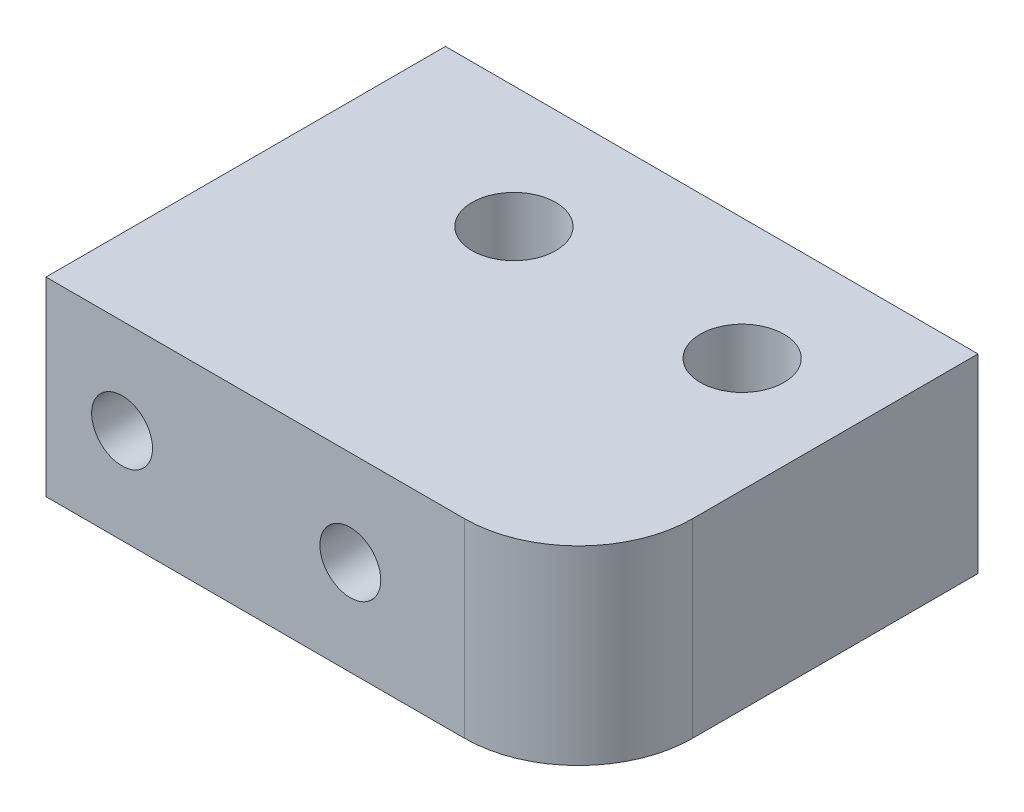
ISO-10303-21;
HEADER;
FILE_DESCRIPTION(('STEP AP214'),'2;1');
FILE_NAME('part.step','',(''),(''),'','','');
FILE_SCHEMA(('AUTOMOTIVE_DESIGN { 1 0 10303 214 1 1 1 1 }'));
ENDSEC;
DATA;
#1=APPLICATION_CONTEXT('core data for automotive mechanical design processes');
#2=APPLICATION_PROTOCOL_DEFINITION('international standard','automotive_design',2000,#1);
#3=PRODUCT_CONTEXT('',#1,'mechanical');
#4=PRODUCT('Part','Part','',(#3));
#5=PRODUCT_RELATED_PRODUCT_CATEGORY('part','',(#4));
#6=PRODUCT_DEFINITION_FORMATION('','',#4);
#7=PRODUCT_DEFINITION_CONTEXT('part definition',#1,'design');
#8=PRODUCT_DEFINITION('design','',#6,#7);
#9=PRODUCT_DEFINITION_SHAPE('','',#8);
#10=(LENGTH_UNIT() NAMED_UNIT(*) SI_UNIT(.MILLI.,.METRE.));
#11=(NAMED_UNIT(*) PLANE_ANGLE_UNIT() SI_UNIT($,.RADIAN.));
#12=(NAMED_UNIT(*) SI_UNIT($,.STERADIAN.) SOLID_ANGLE_UNIT());
#13=UNCERTAINTY_MEASURE_WITH_UNIT(LENGTH_MEASURE(1.E-05),#10,'distance_accuracy_value','');
#14=(GEOMETRIC_REPRESENTATION_CONTEXT(3) GLOBAL_UNCERTAINTY_ASSIGNED_CONTEXT((#13)) GLOBAL_UNIT_ASSIGNED_CONTEXT((#10,
#11,#12)) REPRESENTATION_CONTEXT('',''));
#15=CARTESIAN_POINT('',(0.,0.,0.));
#16=DIRECTION('',(0.,0.,1.));
#17=DIRECTION('',(1.,0.,0.));
#18=AXIS2_PLACEMENT_3D('',#15,#16,#17);
#19=CARTESIAN_POINT('',(7.,5.,-5.25));
#20=DIRECTION('',(-1.,0.,0.));
#21=DIRECTION('',(0.,0.,1.));
#22=AXIS2_PLACEMENT_3D('',#19,#20,#21);
#23=PLANE('',#22);
#24=DIRECTION('',(0.,0.,-1.));
#25=VECTOR('',#24,1.);
#26=CARTESIAN_POINT('',(7.,5.,-5.25));
#27=LINE('',#26,#25);
#28=CARTESIAN_POINT('',(7.,5.,2.25));
#29=VERTEX_POINT('',#28);
#30=CARTESIAN_POINT('',(7.,5.,-5.25));
#31=VERTEX_POINT('',#30);
#32=EDGE_CURVE('E81',#29,#31,#27,.T.);
#33=ORIENTED_EDGE('',*,*,#32,.F.);
#34=DIRECTION('',(0.,-1.,0.));
#35=VECTOR('',#34,1.);
#36=CARTESIAN_POINT('',(7.,5.,2.25));
#37=LINE('',#36,#35);
#38=CARTESIAN_POINT('',(7.,0.,2.25));
#39=VERTEX_POINT('',#38);
#40=EDGE_CURVE('E104',#29,#39,#37,.T.);
#41=ORIENTED_EDGE('',*,*,#40,.T.);
#42=DIRECTION('',(0.,0.,-1.));
#43=VECTOR('',#42,1.);
#44=CARTESIAN_POINT('',(7.,0.,-5.25));
#45=LINE('',#44,#43);
#46=CARTESIAN_POINT('',(7.,0.,-5.25));
#47=VERTEX_POINT('',#46);
#48=EDGE_CURVE('E102',#39,#47,#45,.T.);
#49=ORIENTED_EDGE('',*,*,#48,.T.);
#50=DIRECTION('',(0.,-1.,0.));
#51=VECTOR('',#50,1.);
#52=CARTESIAN_POINT('',(7.,5.,-5.25));
#53=LINE('',#52,#51);
#54=EDGE_CURVE('E96',#31,#47,#53,.T.);
#55=ORIENTED_EDGE('',*,*,#54,.F.);
#56=EDGE_LOOP('',(#33,#41,#49,#55));
#57=FACE_BOUND('',#56,.T.);
#58=ADVANCED_FACE('F35',(#57),#23,.F.);
#59=CARTESIAN_POINT('',(-7.,5.,-5.25));
#60=DIRECTION('',(0.,0.,1.));
#61=DIRECTION('',(1.,0.,0.));
#62=AXIS2_PLACEMENT_3D('',#59,#60,#61);
#63=PLANE('',#62);
#64=CARTESIAN_POINT('',(-5.,2.5,-5.25));
#65=DIRECTION('',(0.,0.,1.));
#66=DIRECTION('',(1.,0.,0.));
#67=AXIS2_PLACEMENT_3D('',#64,#65,#66);
#68=CIRCLE('',#67,0.799999999999997);
#69=CARTESIAN_POINT('',(-4.2,2.5,-5.25));
#70=VERTEX_POINT('',#69);
#71=EDGE_CURVE('E152',#70,#70,#68,.T.);
#72=ORIENTED_EDGE('',*,*,#71,.T.);
#73=EDGE_LOOP('',(#72));
#74=FACE_BOUND('',#73,.T.);
#75=CARTESIAN_POINT('',(1.,2.5,-5.25));
#76=DIRECTION('',(0.,0.,1.));
#77=DIRECTION('',(1.,0.,0.));
#78=AXIS2_PLACEMENT_3D('',#75,#76,#77);
#79=CIRCLE('',#78,0.799999999999997);
#80=CARTESIAN_POINT('',(1.8,2.5,-5.25));
#81=VERTEX_POINT('',#80);
#82=EDGE_CURVE('E146',#81,#81,#79,.T.);
#83=ORIENTED_EDGE('',*,*,#82,.T.);
#84=EDGE_LOOP('',(#83));
#85=FACE_BOUND('',#84,.T.);
#86=DIRECTION('',(-1.,0.,0.));
#87=VECTOR('',#86,1.);
#88=CARTESIAN_POINT('',(-7.,0.,-5.25));
#89=LINE('',#88,#87);
#90=CARTESIAN_POINT('',(-7.,0.,-5.25));
#91=VERTEX_POINT('',#90);
#92=EDGE_CURVE('E117',#47,#91,#89,.T.);
#93=ORIENTED_EDGE('',*,*,#92,.T.);
#94=DIRECTION('',(0.,-1.,0.));
#95=VECTOR('',#94,1.);
#96=CARTESIAN_POINT('',(-7.,5.,-5.25));
#97=LINE('',#96,#95);
#98=CARTESIAN_POINT('',(-7.,5.,-5.25));
#99=VERTEX_POINT('',#98);
#100=EDGE_CURVE('E98',#99,#91,#97,.T.);
#101=ORIENTED_EDGE('',*,*,#100,.F.);
#102=DIRECTION('',(-1.,0.,0.));
#103=VECTOR('',#102,1.);
#104=CARTESIAN_POINT('',(-7.,5.,-5.25));
#105=LINE('',#104,#103);
#106=EDGE_CURVE('E84',#31,#99,#105,.T.);
#107=ORIENTED_EDGE('',*,*,#106,.F.);
#108=ORIENTED_EDGE('',*,*,#54,.T.);
#109=EDGE_LOOP('',(#93,#101,#107,#108));
#110=FACE_BOUND('',#109,.T.);
#111=ADVANCED_FACE('F95',(#74,#85,#110),#63,.F.);
#112=CARTESIAN_POINT('',(-7.,5.,-5.25));
#113=DIRECTION('',(1.,0.,0.));
#114=DIRECTION('',(0.,0.,-1.));
#115=AXIS2_PLACEMENT_3D('',#112,#113,#114);
#116=PLANE('',#115);
#117=DIRECTION('',(0.,0.,1.));
#118=VECTOR('',#117,1.);
#119=CARTESIAN_POINT('',(-7.,0.,-5.25));
#120=LINE('',#119,#118);
#121=CARTESIAN_POINT('',(-7.,0.,5.25));
#122=VERTEX_POINT('',#121);
#123=EDGE_CURVE('E115',#91,#122,#120,.T.);
#124=ORIENTED_EDGE('',*,*,#123,.T.);
#125=DIRECTION('',(0.,-1.,0.));
#126=VECTOR('',#125,1.);
#127=CARTESIAN_POINT('',(-7.,5.,5.25));
#128=LINE('',#127,#126);
#129=CARTESIAN_POINT('',(-7.,5.,5.25));
#130=VERTEX_POINT('',#129);
#131=EDGE_CURVE('E107',#130,#122,#128,.T.);
#132=ORIENTED_EDGE('',*,*,#131,.F.);
#133=DIRECTION('',(0.,0.,1.));
#134=VECTOR('',#133,1.);
#135=CARTESIAN_POINT('',(-7.,5.,-5.25));
#136=LINE('',#135,#134);
#137=EDGE_CURVE('E100',#99,#130,#136,.T.);
#138=ORIENTED_EDGE('',*,*,#137,.F.);
#139=ORIENTED_EDGE('',*,*,#100,.T.);
#140=EDGE_LOOP('',(#124,#132,#138,#139));
#141=FACE_BOUND('',#140,.T.);
#142=ADVANCED_FACE('F164',(#141),#116,.F.);
#143=CARTESIAN_POINT('',(-7.,5.,5.25));
#144=DIRECTION('',(0.,0.,-1.));
#145=DIRECTION('',(-1.,0.,0.));
#146=AXIS2_PLACEMENT_3D('',#143,#144,#145);
#147=PLANE('',#146);
#148=CARTESIAN_POINT('',(-5.,2.5,5.25));
#149=DIRECTION('',(0.,0.,1.));
#150=DIRECTION('',(1.,0.,0.));
#151=AXIS2_PLACEMENT_3D('',#148,#149,#150);
#152=CIRCLE('',#151,0.799999999999988);
#153=CARTESIAN_POINT('',(-4.20000000000001,2.5,5.25));
#154=VERTEX_POINT('',#153);
#155=EDGE_CURVE('E155',#154,#154,#152,.T.);
#156=ORIENTED_EDGE('',*,*,#155,.F.);
#157=EDGE_LOOP('',(#156));
#158=FACE_BOUND('',#157,.T.);
#159=CARTESIAN_POINT('',(1.,2.5,5.25));
#160=DIRECTION('',(0.,0.,1.));
#161=DIRECTION('',(1.,0.,0.));
#162=AXIS2_PLACEMENT_3D('',#159,#160,#161);
#163=CIRCLE('',#162,0.799999999999988);
#164=CARTESIAN_POINT('',(1.79999999999999,2.5,5.25));
#165=VERTEX_POINT('',#164);
#166=EDGE_CURVE('E149',#165,#165,#163,.T.);
#167=ORIENTED_EDGE('',*,*,#166,.F.);
#168=EDGE_LOOP('',(#167));
#169=FACE_BOUND('',#168,.T.);
#170=DIRECTION('',(1.,0.,0.));
#171=VECTOR('',#170,1.);
#172=CARTESIAN_POINT('',(-7.,0.,5.25));
#173=LINE('',#172,#171);
#174=CARTESIAN_POINT('',(4.,0.,5.25));
#175=VERTEX_POINT('',#174);
#176=EDGE_CURVE('E91',#122,#175,#173,.T.);
#177=ORIENTED_EDGE('',*,*,#176,.T.);
#178=DIRECTION('',(0.,-1.,0.));
#179=VECTOR('',#178,1.);
#180=CARTESIAN_POINT('',(4.,5.,5.25));
#181=LINE('',#180,#179);
#182=CARTESIAN_POINT('',(4.,5.,5.25));
#183=VERTEX_POINT('',#182);
#184=EDGE_CURVE('E43',#175,#183,#181,.F.);
#185=ORIENTED_EDGE('',*,*,#184,.T.);
#186=DIRECTION('',(1.,0.,0.));
#187=VECTOR('',#186,1.);
#188=CARTESIAN_POINT('',(-7.,5.,5.25));
#189=LINE('',#188,#187);
#190=EDGE_CURVE('E113',#130,#183,#189,.T.);
#191=ORIENTED_EDGE('',*,*,#190,.F.);
#192=ORIENTED_EDGE('',*,*,#131,.T.);
#193=EDGE_LOOP('',(#177,#185,#191,#192));
#194=FACE_BOUND('',#193,.T.);
#195=ADVANCED_FACE('F161',(#158,#169,#194),#147,.F.);
#196=CARTESIAN_POINT('',(0.,5.,0.));
#197=DIRECTION('',(0.,1.,0.));
#198=DIRECTION('',(0.,0.,1.));
#199=AXIS2_PLACEMENT_3D('',#196,#197,#198);
#200=PLANE('',#199);
#201=CARTESIAN_POINT('',(-2.,5.,-2.05));
#202=DIRECTION('',(0.,-1.,0.));
#203=DIRECTION('',(0.,0.,-1.));
#204=AXIS2_PLACEMENT_3D('',#201,#202,#203);
#205=CIRCLE('',#204,1.10000000000001);
#206=CARTESIAN_POINT('',(-2.,5.,-3.15000000000001));
#207=VERTEX_POINT('',#206);
#208=EDGE_CURVE('E134',#207,#207,#205,.T.);
#209=ORIENTED_EDGE('',*,*,#208,.T.);
#210=EDGE_LOOP('',(#209));
#211=FACE_BOUND('',#210,.T.);
#212=CARTESIAN_POINT('',(4.,5.,-2.05));
#213=DIRECTION('',(0.,-1.,0.));
#214=DIRECTION('',(0.,0.,-1.));
#215=AXIS2_PLACEMENT_3D('',#212,#213,#214);
#216=CIRCLE('',#215,1.10000000000001);
#217=CARTESIAN_POINT('',(4.,5.,-3.15000000000001));
#218=VERTEX_POINT('',#217);
#219=EDGE_CURVE('E120',#218,#218,#216,.T.);
#220=ORIENTED_EDGE('',*,*,#219,.T.);
#221=EDGE_LOOP('',(#220));
#222=FACE_BOUND('',#221,.T.);
#223=ORIENTED_EDGE('',*,*,#190,.T.);
#224=CARTESIAN_POINT('',(4.,5.,2.25));
#225=DIRECTION('',(0.,1.,0.));
#226=DIRECTION('',(0.,0.,1.));
#227=AXIS2_PLACEMENT_3D('',#224,#225,#226);
#228=CIRCLE('',#227,3.);
#229=EDGE_CURVE('E11',#183,#29,#228,.T.);
#230=ORIENTED_EDGE('',*,*,#229,.T.);
#231=ORIENTED_EDGE('',*,*,#32,.T.);
#232=ORIENTED_EDGE('',*,*,#106,.T.);
#233=ORIENTED_EDGE('',*,*,#137,.T.);
#234=EDGE_LOOP('',(#223,#230,#231,#232,#233));
#235=FACE_BOUND('',#234,.T.);
#236=ADVANCED_FACE('F83',(#211,#222,#235),#200,.T.);
#237=CARTESIAN_POINT('',(0.,0.,0.));
#238=DIRECTION('',(0.,1.,0.));
#239=DIRECTION('',(0.,0.,1.));
#240=AXIS2_PLACEMENT_3D('',#237,#238,#239);
#241=PLANE('',#240);
#242=CARTESIAN_POINT('',(-2.,0.,-2.05));
#243=DIRECTION('',(0.,-1.,0.));
#244=DIRECTION('',(0.,0.,-1.));
#245=AXIS2_PLACEMENT_3D('',#242,#243,#244);
#246=CIRCLE('',#245,2.10000000000002);
#247=CARTESIAN_POINT('',(-2.,0.,-4.15000000000001));
#248=VERTEX_POINT('',#247);
#249=EDGE_CURVE('E143',#248,#248,#246,.T.);
#250=ORIENTED_EDGE('',*,*,#249,.F.);
#251=EDGE_LOOP('',(#250));
#252=FACE_BOUND('',#251,.T.);
#253=CARTESIAN_POINT('',(4.,0.,-2.05));
#254=DIRECTION('',(0.,-1.,0.));
#255=DIRECTION('',(0.,0.,-1.));
#256=AXIS2_PLACEMENT_3D('',#253,#254,#255);
#257=CIRCLE('',#256,2.10000000000002);
#258=CARTESIAN_POINT('',(4.,0.,-4.15000000000001));
#259=VERTEX_POINT('',#258);
#260=EDGE_CURVE('E131',#259,#259,#257,.T.);
#261=ORIENTED_EDGE('',*,*,#260,.F.);
#262=EDGE_LOOP('',(#261));
#263=FACE_BOUND('',#262,.T.);
#264=ORIENTED_EDGE('',*,*,#48,.F.);
#265=CARTESIAN_POINT('',(4.,0.,2.25));
#266=DIRECTION('',(0.,1.,0.));
#267=DIRECTION('',(0.,0.,1.));
#268=AXIS2_PLACEMENT_3D('',#265,#266,#267);
#269=CIRCLE('',#268,3.);
#270=EDGE_CURVE('E57',#39,#175,#269,.F.);
#271=ORIENTED_EDGE('',*,*,#270,.T.);
#272=ORIENTED_EDGE('',*,*,#176,.F.);
#273=ORIENTED_EDGE('',*,*,#123,.F.);
#274=ORIENTED_EDGE('',*,*,#92,.F.);
#275=EDGE_LOOP('',(#264,#271,#272,#273,#274));
#276=FACE_BOUND('',#275,.T.);
#277=ADVANCED_FACE('F170',(#252,#263,#276),#241,.F.);
#278=CARTESIAN_POINT('',(4.,0.,-2.05));
#279=DIRECTION('',(0.,-1.,0.));
#280=DIRECTION('',(0.,0.,-1.));
#281=AXIS2_PLACEMENT_3D('',#278,#279,#280);
#282=CYLINDRICAL_SURFACE('',#281,1.10000000000001);
#283=ORIENTED_EDGE('',*,*,#219,.F.);
#284=EDGE_LOOP('',(#283));
#285=FACE_BOUND('',#284,.T.);
#286=CARTESIAN_POINT('',(4.,1.3,-2.05));
#287=DIRECTION('',(0.,-1.,0.));
#288=DIRECTION('',(0.,0.,-1.));
#289=AXIS2_PLACEMENT_3D('',#286,#287,#288);
#290=CIRCLE('',#289,1.10000000000001);
#291=CARTESIAN_POINT('',(4.,1.3,-3.15000000000001));
#292=VERTEX_POINT('',#291);
#293=EDGE_CURVE('E125',#292,#292,#290,.T.);
#294=ORIENTED_EDGE('',*,*,#293,.T.);
#295=EDGE_LOOP('',(#294));
#296=FACE_BOUND('',#295,.T.);
#297=ADVANCED_FACE('F267',(#285,#296),#282,.F.);
#298=CARTESIAN_POINT('',(5.10000000000001,1.3,-2.05));
#299=DIRECTION('',(0.,1.,0.));
#300=DIRECTION('',(0.,0.,1.));
#301=AXIS2_PLACEMENT_3D('',#298,#299,#300);
#302=PLANE('',#301);
#303=ORIENTED_EDGE('',*,*,#293,.F.);
#304=EDGE_LOOP('',(#303));
#305=FACE_BOUND('',#304,.T.);
#306=CARTESIAN_POINT('',(4.,1.3,-2.05));
#307=DIRECTION('',(0.,-1.,0.));
#308=DIRECTION('',(0.,0.,-1.));
#309=AXIS2_PLACEMENT_3D('',#306,#307,#308);
#310=CIRCLE('',#309,2.10000000000001);
#311=CARTESIAN_POINT('',(4.,1.3,-4.15000000000001));
#312=VERTEX_POINT('',#311);
#313=EDGE_CURVE('E128',#312,#312,#310,.T.);
#314=ORIENTED_EDGE('',*,*,#313,.T.);
#315=EDGE_LOOP('',(#314));
#316=FACE_BOUND('',#315,.T.);
#317=ADVANCED_FACE('F259',(#305,#316),#302,.F.);
#318=CARTESIAN_POINT('',(4.,0.,-2.05));
#319=DIRECTION('',(0.,-1.,0.));
#320=DIRECTION('',(0.,0.,-1.));
#321=AXIS2_PLACEMENT_3D('',#318,#319,#320);
#322=CYLINDRICAL_SURFACE('',#321,2.10000000000001);
#323=ORIENTED_EDGE('',*,*,#313,.F.);
#324=EDGE_LOOP('',(#323));
#325=FACE_BOUND('',#324,.T.);
#326=ORIENTED_EDGE('',*,*,#260,.T.);
#327=EDGE_LOOP('',(#326));
#328=FACE_BOUND('',#327,.T.);
#329=ADVANCED_FACE('F251',(#325,#328),#322,.F.);
#330=CARTESIAN_POINT('',(-2.,0.,-2.05));
#331=DIRECTION('',(0.,-1.,0.));
#332=DIRECTION('',(0.,0.,-1.));
#333=AXIS2_PLACEMENT_3D('',#330,#331,#332);
#334=CYLINDRICAL_SURFACE('',#333,1.10000000000001);
#335=ORIENTED_EDGE('',*,*,#208,.F.);
#336=EDGE_LOOP('',(#335));
#337=FACE_BOUND('',#336,.T.);
#338=CARTESIAN_POINT('',(-2.,1.3,-2.05));
#339=DIRECTION('',(0.,-1.,0.));
#340=DIRECTION('',(0.,0.,-1.));
#341=AXIS2_PLACEMENT_3D('',#338,#339,#340);
#342=CIRCLE('',#341,1.10000000000001);
#343=CARTESIAN_POINT('',(-2.,1.3,-3.15000000000001));
#344=VERTEX_POINT('',#343);
#345=EDGE_CURVE('E137',#344,#344,#342,.T.);
#346=ORIENTED_EDGE('',*,*,#345,.T.);
#347=EDGE_LOOP('',(#346));
#348=FACE_BOUND('',#347,.T.);
#349=ADVANCED_FACE('F243',(#337,#348),#334,.F.);
#350=CARTESIAN_POINT('',(-0.899999999999985,1.3,-2.05));
#351=DIRECTION('',(0.,1.,0.));
#352=DIRECTION('',(0.,0.,1.));
#353=AXIS2_PLACEMENT_3D('',#350,#351,#352);
#354=PLANE('',#353);
#355=ORIENTED_EDGE('',*,*,#345,.F.);
#356=EDGE_LOOP('',(#355));
#357=FACE_BOUND('',#356,.T.);
#358=CARTESIAN_POINT('',(-2.,1.3,-2.05));
#359=DIRECTION('',(0.,-1.,0.));
#360=DIRECTION('',(0.,0.,-1.));
#361=AXIS2_PLACEMENT_3D('',#358,#359,#360);
#362=CIRCLE('',#361,2.10000000000001);
#363=CARTESIAN_POINT('',(-2.,1.3,-4.15000000000001));
#364=VERTEX_POINT('',#363);
#365=EDGE_CURVE('E140',#364,#364,#362,.T.);
#366=ORIENTED_EDGE('',*,*,#365,.T.);
#367=EDGE_LOOP('',(#366));
#368=FACE_BOUND('',#367,.T.);
#369=ADVANCED_FACE('F235',(#357,#368),#354,.F.);
#370=CARTESIAN_POINT('',(-2.,0.,-2.05));
#371=DIRECTION('',(0.,-1.,0.));
#372=DIRECTION('',(0.,0.,-1.));
#373=AXIS2_PLACEMENT_3D('',#370,#371,#372);
#374=CYLINDRICAL_SURFACE('',#373,2.10000000000001);
#375=ORIENTED_EDGE('',*,*,#365,.F.);
#376=EDGE_LOOP('',(#375));
#377=FACE_BOUND('',#376,.T.);
#378=ORIENTED_EDGE('',*,*,#249,.T.);
#379=EDGE_LOOP('',(#378));
#380=FACE_BOUND('',#379,.T.);
#381=ADVANCED_FACE('F232',(#377,#380),#374,.F.);
#382=CARTESIAN_POINT('',(4.,5.,2.25));
#383=DIRECTION('',(0.,-1.,0.));
#384=DIRECTION('',(0.,0.,-1.));
#385=AXIS2_PLACEMENT_3D('',#382,#383,#384);
#386=CYLINDRICAL_SURFACE('',#385,3.);
#387=ORIENTED_EDGE('',*,*,#229,.F.);
#388=ORIENTED_EDGE('',*,*,#184,.F.);
#389=ORIENTED_EDGE('',*,*,#270,.F.);
#390=ORIENTED_EDGE('',*,*,#40,.F.);
#391=EDGE_LOOP('',(#387,#388,#389,#390));
#392=FACE_BOUND('',#391,.T.);
#393=ADVANCED_FACE('F37',(#392),#386,.T.);
#394=CARTESIAN_POINT('',(1.,2.5,5.25));
#395=DIRECTION('',(0.,0.,1.));
#396=DIRECTION('',(1.,0.,0.));
#397=AXIS2_PLACEMENT_3D('',#394,#395,#396);
#398=CYLINDRICAL_SURFACE('',#397,0.799999999999993);
#399=ORIENTED_EDGE('',*,*,#82,.F.);
#400=EDGE_LOOP('',(#399));
#401=FACE_BOUND('',#400,.T.);
#402=ORIENTED_EDGE('',*,*,#166,.T.);
#403=EDGE_LOOP('',(#402));
#404=FACE_BOUND('',#403,.T.);
#405=ADVANCED_FACE('F207',(#401,#404),#398,.F.);
#406=CARTESIAN_POINT('',(-5.,2.5,5.25));
#407=DIRECTION('',(0.,0.,1.));
#408=DIRECTION('',(1.,0.,0.));
#409=AXIS2_PLACEMENT_3D('',#406,#407,#408);
#410=CYLINDRICAL_SURFACE('',#409,0.799999999999993);
#411=ORIENTED_EDGE('',*,*,#71,.F.);
#412=EDGE_LOOP('',(#411));
#413=FACE_BOUND('',#412,.T.);
#414=ORIENTED_EDGE('',*,*,#155,.T.);
#415=EDGE_LOOP('',(#414));
#416=FACE_BOUND('',#415,.T.);
#417=ADVANCED_FACE('F159',(#413,#416),#410,.F.);
#418=CLOSED_SHELL('',(#58,#111,#142,#195,#236,#277,#297,#317,#329,#349,#369,#381,#393,#405,#417));
#419=MANIFOLD_SOLID_BREP('B2',#418);
#420=ADVANCED_BREP_SHAPE_REPRESENTATION('',(#18,#419),#14);
#421=SHAPE_DEFINITION_REPRESENTATION(#9,#420);
ENDSEC;
END-ISO-10303-21;
